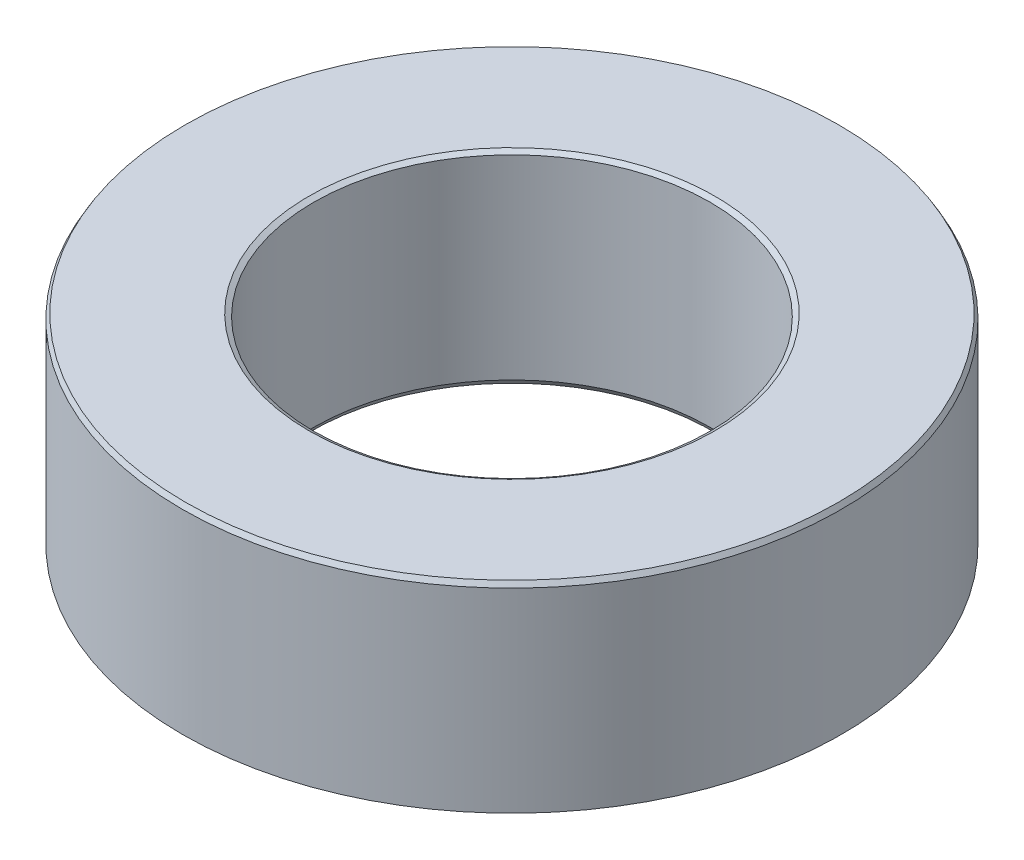
ISO-10303-21;
HEADER;
FILE_DESCRIPTION(('STEP AP214'),'2;1');
FILE_NAME('part.step','',(''),(''),'','','');
FILE_SCHEMA(('AUTOMOTIVE_DESIGN { 1 0 10303 214 1 1 1 1 }'));
ENDSEC;
DATA;
#1=APPLICATION_CONTEXT('core data for automotive mechanical design processes');
#2=APPLICATION_PROTOCOL_DEFINITION('international standard','automotive_design',2000,#1);
#3=PRODUCT_CONTEXT('',#1,'mechanical');
#4=PRODUCT('Part','Part','',(#3));
#5=PRODUCT_RELATED_PRODUCT_CATEGORY('part','',(#4));
#6=PRODUCT_DEFINITION_FORMATION('','',#4);
#7=PRODUCT_DEFINITION_CONTEXT('part definition',#1,'design');
#8=PRODUCT_DEFINITION('design','',#6,#7);
#9=PRODUCT_DEFINITION_SHAPE('','',#8);
#10=(LENGTH_UNIT() NAMED_UNIT(*) SI_UNIT(.MILLI.,.METRE.));
#11=(NAMED_UNIT(*) PLANE_ANGLE_UNIT() SI_UNIT($,.RADIAN.));
#12=(NAMED_UNIT(*) SI_UNIT($,.STERADIAN.) SOLID_ANGLE_UNIT());
#13=UNCERTAINTY_MEASURE_WITH_UNIT(LENGTH_MEASURE(1.E-05),#10,'distance_accuracy_value','');
#14=(GEOMETRIC_REPRESENTATION_CONTEXT(3) GLOBAL_UNCERTAINTY_ASSIGNED_CONTEXT((#13)) GLOBAL_UNIT_ASSIGNED_CONTEXT((#10,
#11,#12)) REPRESENTATION_CONTEXT('',''));
#15=CARTESIAN_POINT('',(0.,0.,0.));
#16=DIRECTION('',(0.,0.,1.));
#17=DIRECTION('',(1.,0.,0.));
#18=AXIS2_PLACEMENT_3D('',#15,#16,#17);
#19=CARTESIAN_POINT('',(0.,15.3688232967677,0.));
#20=DIRECTION('',(0.,-1.,0.));
#21=DIRECTION('',(0.,0.,-1.));
#22=AXIS2_PLACEMENT_3D('',#19,#20,#21);
#23=CYLINDRICAL_SURFACE('',#22,25.);
#24=CARTESIAN_POINT('',(0.,0.212274192182312,0.));
#25=DIRECTION('',(0.,1.,0.));
#26=DIRECTION('',(0.,0.,1.));
#27=AXIS2_PLACEMENT_3D('',#24,#25,#26);
#28=CIRCLE('',#27,25.);
#29=CARTESIAN_POINT('',(0.,0.212274192182312,25.));
#30=VERTEX_POINT('',#29);
#31=EDGE_CURVE('E10',#30,#30,#28,.T.);
#32=ORIENTED_EDGE('',*,*,#31,.T.);
#33=EDGE_LOOP('',(#32));
#34=FACE_BOUND('',#33,.T.);
#35=CARTESIAN_POINT('',(0.,15.0011536107723,0.));
#36=DIRECTION('',(0.,1.,0.));
#37=DIRECTION('',(0.,0.,1.));
#38=AXIS2_PLACEMENT_3D('',#35,#36,#37);
#39=CIRCLE('',#38,25.);
#40=CARTESIAN_POINT('',(0.,15.0011536107723,25.));
#41=VERTEX_POINT('',#40);
#42=EDGE_CURVE('E50',#41,#41,#39,.F.);
#43=ORIENTED_EDGE('',*,*,#42,.T.);
#44=EDGE_LOOP('',(#43));
#45=FACE_BOUND('',#44,.T.);
#46=ADVANCED_FACE('F39',(#34,#45),#23,.T.);
#47=CARTESIAN_POINT('',(0.,15.3688232967677,0.));
#48=DIRECTION('',(0.,1.,0.));
#49=DIRECTION('',(0.,0.,1.));
#50=AXIS2_PLACEMENT_3D('',#47,#48,#49);
#51=PLANE('',#50);
#52=CARTESIAN_POINT('',(0.,15.3688232967677,0.));
#53=DIRECTION('',(0.,1.,0.));
#54=DIRECTION('',(0.,0.,1.));
#55=AXIS2_PLACEMENT_3D('',#52,#53,#54);
#56=CIRCLE('',#55,15.4087550215514);
#57=CARTESIAN_POINT('',(0.,15.3688232967677,15.4087550215514));
#58=VERTEX_POINT('',#57);
#59=EDGE_CURVE('E58',#58,#58,#56,.F.);
#60=ORIENTED_EDGE('',*,*,#59,.T.);
#61=EDGE_LOOP('',(#60));
#62=FACE_BOUND('',#61,.T.);
#63=CARTESIAN_POINT('',(0.,15.3688232967677,0.));
#64=DIRECTION('',(0.,1.,0.));
#65=DIRECTION('',(0.,0.,1.));
#66=AXIS2_PLACEMENT_3D('',#63,#64,#65);
#67=CIRCLE('',#66,24.7877258078177);
#68=CARTESIAN_POINT('',(0.,15.3688232967677,24.7877258078177));
#69=VERTEX_POINT('',#68);
#70=EDGE_CURVE('E61',#69,#69,#67,.T.);
#71=ORIENTED_EDGE('',*,*,#70,.T.);
#72=EDGE_LOOP('',(#71));
#73=FACE_BOUND('',#72,.T.);
#74=ADVANCED_FACE('F88',(#62,#73),#51,.T.);
#75=CARTESIAN_POINT('',(0.,0.,0.));
#76=DIRECTION('',(0.,1.,0.));
#77=DIRECTION('',(0.,0.,1.));
#78=AXIS2_PLACEMENT_3D('',#75,#76,#77);
#79=PLANE('',#78);
#80=CARTESIAN_POINT('',(0.,0.,0.));
#81=DIRECTION('',(0.,1.,0.));
#82=DIRECTION('',(0.,0.,1.));
#83=AXIS2_PLACEMENT_3D('',#80,#81,#82);
#84=CIRCLE('',#83,15.2533595277383);
#85=CARTESIAN_POINT('',(0.,0.,15.2533595277383));
#86=VERTEX_POINT('',#85);
#87=EDGE_CURVE('E51',#86,#86,#84,.T.);
#88=ORIENTED_EDGE('',*,*,#87,.T.);
#89=EDGE_LOOP('',(#88));
#90=FACE_BOUND('',#89,.T.);
#91=CARTESIAN_POINT('',(0.,0.,0.));
#92=DIRECTION('',(0.,1.,0.));
#93=DIRECTION('',(0.,0.,1.));
#94=AXIS2_PLACEMENT_3D('',#91,#92,#93);
#95=CIRCLE('',#94,24.6323303140046);
#96=CARTESIAN_POINT('',(0.,0.,24.6323303140046));
#97=VERTEX_POINT('',#96);
#98=EDGE_CURVE('E54',#97,#97,#95,.F.);
#99=ORIENTED_EDGE('',*,*,#98,.T.);
#100=EDGE_LOOP('',(#99));
#101=FACE_BOUND('',#100,.T.);
#102=ADVANCED_FACE('F83',(#90,#101),#79,.F.);
#103=CARTESIAN_POINT('',(0.,15.3688232967677,0.));
#104=DIRECTION('',(0.,-1.,0.));
#105=DIRECTION('',(0.,0.,-1.));
#106=AXIS2_PLACEMENT_3D('',#103,#104,#105);
#107=CYLINDRICAL_SURFACE('',#106,15.041085335556);
#108=CARTESIAN_POINT('',(0.,15.1565491045854,0.));
#109=DIRECTION('',(0.,1.,0.));
#110=DIRECTION('',(0.,0.,1.));
#111=AXIS2_PLACEMENT_3D('',#108,#109,#110);
#112=CIRCLE('',#111,15.041085335556);
#113=CARTESIAN_POINT('',(0.,15.1565491045854,15.041085335556));
#114=VERTEX_POINT('',#113);
#115=EDGE_CURVE('E67',#114,#114,#112,.T.);
#116=ORIENTED_EDGE('',*,*,#115,.T.);
#117=EDGE_LOOP('',(#116));
#118=FACE_BOUND('',#117,.T.);
#119=CARTESIAN_POINT('',(0.,0.367669685995418,0.));
#120=DIRECTION('',(0.,1.,0.));
#121=DIRECTION('',(0.,0.,1.));
#122=AXIS2_PLACEMENT_3D('',#119,#120,#121);
#123=CIRCLE('',#122,15.041085335556);
#124=CARTESIAN_POINT('',(0.,0.367669685995418,15.041085335556));
#125=VERTEX_POINT('',#124);
#126=EDGE_CURVE('E69',#125,#125,#123,.F.);
#127=ORIENTED_EDGE('',*,*,#126,.T.);
#128=EDGE_LOOP('',(#127));
#129=FACE_BOUND('',#128,.T.);
#130=ADVANCED_FACE('F71',(#118,#129),#107,.F.);
#131=CARTESIAN_POINT('',(0.,15.1565491045854,0.));
#132=DIRECTION('',(0.,1.,0.));
#133=DIRECTION('',(0.,0.,1.));
#134=AXIS2_PLACEMENT_3D('',#131,#132,#133);
#135=CONICAL_SURFACE('',#134,15.041085335556,1.04719755119661);
#136=CARTESIAN_POINT('',(0.,15.3688232967677,15.4087550215514));
#137=CARTESIAN_POINT('',(0.,15.3666121072658,15.4049251289889));
#138=CARTESIAN_POINT('',(0.,15.3644009177639,15.4010952364265));
#139=CARTESIAN_POINT('',(0.,15.3599785387601,15.3934354513016));
#140=CARTESIAN_POINT('',(0.,15.3577673492582,15.3896055587391));
#141=CARTESIAN_POINT('',(0.,15.3533449702544,15.3819457736142));
#142=CARTESIAN_POINT('',(0.,15.3511337807525,15.3781158810518));
#143=CARTESIAN_POINT('',(0.,15.3467114017487,15.3704560959269));
#144=CARTESIAN_POINT('',(0.,15.3445002122468,15.3666262033644));
#145=CARTESIAN_POINT('',(0.,15.340077833243,15.3589664182395));
#146=CARTESIAN_POINT('',(0.,15.3378666437411,15.355136525677));
#147=CARTESIAN_POINT('',(0.,15.3334442647373,15.3474767405521));
#148=CARTESIAN_POINT('',(0.,15.3312330752354,15.3436468479897));
#149=CARTESIAN_POINT('',(0.,15.3268106962316,15.3359870628648));
#150=CARTESIAN_POINT('',(0.,15.3245995067297,15.3321571703023));
#151=CARTESIAN_POINT('',(0.,15.3201771277259,15.3244973851774));
#152=CARTESIAN_POINT('',(0.,15.317965938224,15.320667492615));
#153=CARTESIAN_POINT('',(0.,15.3135435592202,15.3130077074901));
#154=CARTESIAN_POINT('',(0.,15.3113323697183,15.3091778149276));
#155=CARTESIAN_POINT('',(0.,15.3069099907145,15.3015180298027));
#156=CARTESIAN_POINT('',(0.,15.3046988012126,15.2976881372403));
#157=CARTESIAN_POINT('',(0.,15.3002764222088,15.2900283521154));
#158=CARTESIAN_POINT('',(0.,15.2980652327069,15.2861984595529));
#159=CARTESIAN_POINT('',(0.,15.2936428537031,15.278538674428));
#160=CARTESIAN_POINT('',(0.,15.2914316642012,15.2747087818655));
#161=CARTESIAN_POINT('',(0.,15.2870092851974,15.2670489967406));
#162=CARTESIAN_POINT('',(0.,15.2847980956955,15.2632191041782));
#163=CARTESIAN_POINT('',(0.,15.2803757166917,15.2555593190533));
#164=CARTESIAN_POINT('',(0.,15.2781645271898,15.2517294264908));
#165=CARTESIAN_POINT('',(0.,15.273742148186,15.2440696413659));
#166=CARTESIAN_POINT('',(0.,15.2715309586841,15.2402397488035));
#167=CARTESIAN_POINT('',(0.,15.2671085796803,15.2325799636786));
#168=CARTESIAN_POINT('',(0.,15.2648973901784,15.2287500711161));
#169=CARTESIAN_POINT('',(0.,15.2604750111746,15.2210902859912));
#170=CARTESIAN_POINT('',(0.,15.2582638216727,15.2172603934288));
#171=CARTESIAN_POINT('',(0.,15.2538414426689,15.2096006083039));
#172=CARTESIAN_POINT('',(0.,15.251630253167,15.2057707157414));
#173=CARTESIAN_POINT('',(0.,15.2472078741632,15.1981109306165));
#174=CARTESIAN_POINT('',(0.,15.2449966846613,15.1942810380541));
#175=CARTESIAN_POINT('',(0.,15.2405743056575,15.1866212529291));
#176=CARTESIAN_POINT('',(0.,15.2383631161556,15.1827913603667));
#177=CARTESIAN_POINT('',(0.,15.2339407371519,15.1751315752418));
#178=CARTESIAN_POINT('',(0.,15.23172954765,15.1713016826793));
#179=CARTESIAN_POINT('',(0.,15.2273071686462,15.1636418975544));
#180=CARTESIAN_POINT('',(0.,15.2250959791443,15.159812004992));
#181=CARTESIAN_POINT('',(0.,15.2206736001405,15.1521522198671));
#182=CARTESIAN_POINT('',(0.,15.2184624106386,15.1483223273046));
#183=CARTESIAN_POINT('',(0.,15.2140400316348,15.1406625421797));
#184=CARTESIAN_POINT('',(0.,15.2118288421329,15.1368326496173));
#185=CARTESIAN_POINT('',(0.,15.2074064631291,15.1291728644924));
#186=CARTESIAN_POINT('',(0.,15.2051952736272,15.1253429719299));
#187=CARTESIAN_POINT('',(0.,15.2007728946234,15.117683186805));
#188=CARTESIAN_POINT('',(0.,15.1985617051215,15.1138532942426));
#189=CARTESIAN_POINT('',(0.,15.1941393261177,15.1061935091176));
#190=CARTESIAN_POINT('',(0.,15.1919281366158,15.1023636165552));
#191=CARTESIAN_POINT('',(0.,15.187505757612,15.0947038314303));
#192=CARTESIAN_POINT('',(0.,15.1852945681101,15.0908739388678));
#193=CARTESIAN_POINT('',(0.,15.1808721891063,15.0832141537429));
#194=CARTESIAN_POINT('',(0.,15.1786609996044,15.0793842611805));
#195=CARTESIAN_POINT('',(0.,15.1742386206006,15.0717244760556));
#196=CARTESIAN_POINT('',(0.,15.1720274310987,15.0678945834931));
#197=CARTESIAN_POINT('',(0.,15.1676050520949,15.0602347983682));
#198=CARTESIAN_POINT('',(0.,15.165393862593,15.0564049058058));
#199=CARTESIAN_POINT('',(0.,15.1609714835892,15.0487451206809));
#200=CARTESIAN_POINT('',(0.,15.1587602940873,15.0449152281184));
#201=CARTESIAN_POINT('',(0.,15.1565491045854,15.041085335556));
#202=B_SPLINE_CURVE_WITH_KNOTS('',3,(#136,#137,#138,#139,#140,#141,#142,#143,#144,#145,#146,
#147,#148,#149,#150,#151,#152,#153,#154,#155,#156,#157,#158,#159,#160,#161,#162,#163,#164,#165,
#166,#167,#168,#169,#170,#171,#172,#173,#174,#175,#176,#177,#178,#179,#180,#181,#182,#183,#184,
#185,#186,#187,#188,#189,#190,#191,#192,#193,#194,#195,#196,#197,#198,#199,#200,#201),
.UNSPECIFIED.,.F.,.F.,(4,2,2,2,2,2,2,2,2,2,2,2,2,2,2,2,2,2,2,2,2,2,2,2,2,2,2,2,2,2,2,2,4),(0.,
0.0132671370113935,0.0265342740227895,0.0398014110341845,0.0530685480455789,0.066335685056974,
0.0796028220683699,0.0928699590797643,0.106137096091159,0.119404233102555,0.132671370113949,
0.145938507125345,0.159205644136739,0.172472781148134,0.18573991815953,0.199007055170924,
0.21227419218232,0.225541329193714,0.238808466205109,0.252075603216505,0.265342740227899,
0.278609877239294,0.29187701425069,0.305144151262084,0.31841128827348,0.331678425284873,
0.344945562296269,0.358212699307665,0.371479836319059,0.384746973330455,0.39801411034185,
0.411281247353244,0.424548384364639),.UNSPECIFIED.);
#203=EDGE_CURVE('BSEAM77',#58,#114,#202,.T.);
#204=ORIENTED_EDGE('',*,*,#59,.F.);
#205=ORIENTED_EDGE('',*,*,#115,.F.);
#206=ORIENTED_EDGE('',*,*,#203,.T.);
#207=ORIENTED_EDGE('',*,*,#203,.F.);
#208=EDGE_LOOP('',(#204,#206,#205,#207));
#209=FACE_BOUND('',#208,.T.);
#210=ADVANCED_FACE('F77',(#209),#135,.F.);
#211=CARTESIAN_POINT('',(0.,0.,0.));
#212=DIRECTION('',(0.,-1.,0.));
#213=DIRECTION('',(0.,0.,-1.));
#214=AXIS2_PLACEMENT_3D('',#211,#212,#213);
#215=CONICAL_SURFACE('',#214,15.2533595277383,0.523598775598294);
#216=ORIENTED_EDGE('',*,*,#126,.F.);
#217=EDGE_LOOP('',(#216));
#218=FACE_BOUND('',#217,.T.);
#219=ORIENTED_EDGE('',*,*,#87,.F.);
#220=EDGE_LOOP('',(#219));
#221=FACE_BOUND('',#220,.T.);
#222=ADVANCED_FACE('F73',(#218,#221),#215,.F.);
#223=CARTESIAN_POINT('',(0.,0.212274192182312,0.));
#224=DIRECTION('',(0.,1.,0.));
#225=DIRECTION('',(0.,0.,1.));
#226=AXIS2_PLACEMENT_3D('',#223,#224,#225);
#227=CONICAL_SURFACE('',#226,25.,1.0471975511966);
#228=ORIENTED_EDGE('',*,*,#98,.F.);
#229=EDGE_LOOP('',(#228));
#230=FACE_BOUND('',#229,.T.);
#231=ORIENTED_EDGE('',*,*,#31,.F.);
#232=EDGE_LOOP('',(#231));
#233=FACE_BOUND('',#232,.T.);
#234=ADVANCED_FACE('F76',(#230,#233),#227,.T.);
#235=CARTESIAN_POINT('',(0.,15.3688232967677,0.));
#236=DIRECTION('',(0.,-1.,0.));
#237=DIRECTION('',(0.,0.,-1.));
#238=AXIS2_PLACEMENT_3D('',#235,#236,#237);
#239=CONICAL_SURFACE('',#238,24.7877258078177,0.523598775598281);
#240=ORIENTED_EDGE('',*,*,#42,.F.);
#241=EDGE_LOOP('',(#240));
#242=FACE_BOUND('',#241,.T.);
#243=ORIENTED_EDGE('',*,*,#70,.F.);
#244=EDGE_LOOP('',(#243));
#245=FACE_BOUND('',#244,.T.);
#246=ADVANCED_FACE('F45',(#242,#245),#239,.T.);
#247=CLOSED_SHELL('',(#46,#74,#102,#130,#210,#222,#234,#246));
#248=MANIFOLD_SOLID_BREP('B2',#247);
#249=ADVANCED_BREP_SHAPE_REPRESENTATION('',(#18,#248),#14);
#250=SHAPE_DEFINITION_REPRESENTATION(#9,#249);
ENDSEC;
END-ISO-10303-21;
